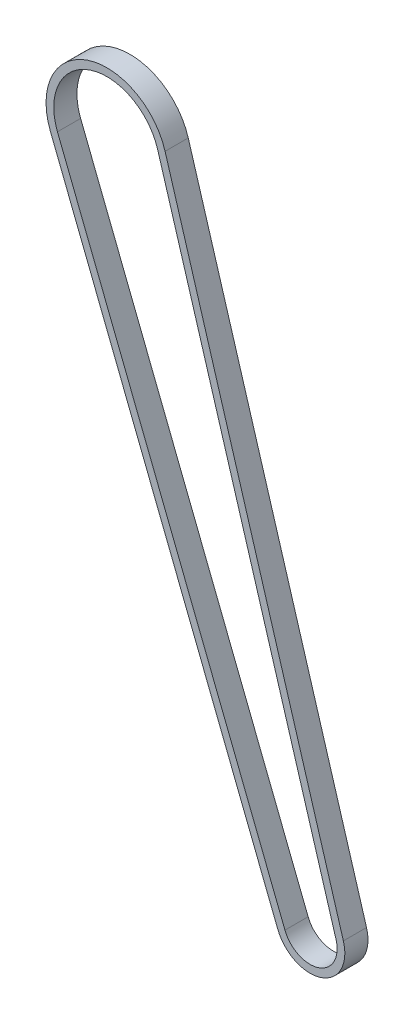
ISO-10303-21;
HEADER;
FILE_DESCRIPTION(('STEP AP214'),'2;1');
FILE_NAME('part.step','',(''),(''),'','','');
FILE_SCHEMA(('AUTOMOTIVE_DESIGN { 1 0 10303 214 1 1 1 1 }'));
ENDSEC;
DATA;
#1=APPLICATION_CONTEXT('core data for automotive mechanical design processes');
#2=APPLICATION_PROTOCOL_DEFINITION('international standard','automotive_design',2000,#1);
#3=PRODUCT_CONTEXT('',#1,'mechanical');
#4=PRODUCT('Part','Part','',(#3));
#5=PRODUCT_RELATED_PRODUCT_CATEGORY('part','',(#4));
#6=PRODUCT_DEFINITION_FORMATION('','',#4);
#7=PRODUCT_DEFINITION_CONTEXT('part definition',#1,'design');
#8=PRODUCT_DEFINITION('design','',#6,#7);
#9=PRODUCT_DEFINITION_SHAPE('','',#8);
#10=(LENGTH_UNIT() NAMED_UNIT(*) SI_UNIT(.MILLI.,.METRE.));
#11=(NAMED_UNIT(*) PLANE_ANGLE_UNIT() SI_UNIT($,.RADIAN.));
#12=(NAMED_UNIT(*) SI_UNIT($,.STERADIAN.) SOLID_ANGLE_UNIT());
#13=UNCERTAINTY_MEASURE_WITH_UNIT(LENGTH_MEASURE(1.E-05),#10,'distance_accuracy_value','');
#14=(GEOMETRIC_REPRESENTATION_CONTEXT(3) GLOBAL_UNCERTAINTY_ASSIGNED_CONTEXT((#13)) GLOBAL_UNIT_ASSIGNED_CONTEXT((#10,
#11,#12)) REPRESENTATION_CONTEXT('',''));
#15=CARTESIAN_POINT('',(0.,0.,0.));
#16=DIRECTION('',(0.,0.,1.));
#17=DIRECTION('',(1.,0.,0.));
#18=AXIS2_PLACEMENT_3D('',#15,#16,#17);
#19=CARTESIAN_POINT('',(0.,-2.22044604925031E-13,8.55000000000016));
#20=DIRECTION('',(0.,0.,1.));
#21=DIRECTION('',(1.,0.,0.));
#22=AXIS2_PLACEMENT_3D('',#19,#20,#21);
#23=CYLINDRICAL_SURFACE('',#22,9.);
#24=CARTESIAN_POINT('',(0.,-2.22044604925031E-13,14.5500000000002));
#25=DIRECTION('',(0.,0.,1.));
#26=DIRECTION('',(-1.,0.,0.));
#27=AXIS2_PLACEMENT_3D('',#24,#25,#26);
#28=CIRCLE('',#27,9.);
#29=CARTESIAN_POINT('',(-8.37394942102628,-3.29802533254295,14.5500000000002));
#30=VERTEX_POINT('',#29);
#31=CARTESIAN_POINT('',(8.6208354949425,2.58480083742218,14.5500000000002));
#32=VERTEX_POINT('',#31);
#33=EDGE_CURVE('E157',#30,#32,#28,.T.);
#34=ORIENTED_EDGE('',*,*,#33,.F.);
#35=DIRECTION('',(0.,0.,1.));
#36=VECTOR('',#35,1.);
#37=CARTESIAN_POINT('',(-8.37394942102628,-3.29802533254295,8.55000000000016));
#38=LINE('',#37,#36);
#39=CARTESIAN_POINT('',(-8.37394942102628,-3.29802533254295,8.55000000000016));
#40=VERTEX_POINT('',#39);
#41=EDGE_CURVE('E12',#40,#30,#38,.T.);
#42=ORIENTED_EDGE('',*,*,#41,.F.);
#43=CARTESIAN_POINT('',(0.,-2.22044604925031E-13,8.55000000000016));
#44=DIRECTION('',(0.,0.,1.));
#45=DIRECTION('',(-1.,0.,0.));
#46=AXIS2_PLACEMENT_3D('',#43,#44,#45);
#47=CIRCLE('',#46,9.);
#48=CARTESIAN_POINT('',(8.6208354949425,2.58480083742218,8.55000000000016));
#49=VERTEX_POINT('',#48);
#50=EDGE_CURVE('E161',#40,#49,#47,.T.);
#51=ORIENTED_EDGE('',*,*,#50,.T.);
#52=DIRECTION('',(0.,0.,1.));
#53=VECTOR('',#52,1.);
#54=CARTESIAN_POINT('',(8.6208354949425,2.58480083742218,8.55000000000016));
#55=LINE('',#54,#53);
#56=EDGE_CURVE('E62',#49,#32,#55,.T.);
#57=ORIENTED_EDGE('',*,*,#56,.T.);
#58=EDGE_LOOP('',(#34,#42,#51,#57));
#59=FACE_BOUND('',#58,.T.);
#60=ADVANCED_FACE('F59',(#59),#23,.T.);
#61=CARTESIAN_POINT('',(-8.37394942102628,-3.29802533254295,8.55000000000016));
#62=DIRECTION('',(-0.930438824558476,-0.366447259171415,0.));
#63=DIRECTION('',(0.366447259171415,-0.930438824558476,0.));
#64=AXIS2_PLACEMENT_3D('',#61,#62,#63);
#65=PLANE('',#64);
#66=DIRECTION('',(0.366447259171415,-0.930438824558476,0.));
#67=VECTOR('',#66,1.);
#68=CARTESIAN_POINT('',(-8.37394942102628,-3.29802533254295,14.5500000000002));
#69=LINE('',#68,#67);
#70=CARTESIAN_POINT('',(-67.3132086137336,146.353455668049,14.5500000000002));
#71=VERTEX_POINT('',#70);
#72=EDGE_CURVE('E165',#71,#30,#69,.T.);
#73=ORIENTED_EDGE('',*,*,#72,.F.);
#74=DIRECTION('',(0.,0.,1.));
#75=VECTOR('',#74,1.);
#76=CARTESIAN_POINT('',(-67.3132086137336,146.353455668049,8.55000000000016));
#77=LINE('',#76,#75);
#78=CARTESIAN_POINT('',(-67.3132086137336,146.353455668049,8.55000000000016));
#79=VERTEX_POINT('',#78);
#80=EDGE_CURVE('E67',#79,#71,#77,.T.);
#81=ORIENTED_EDGE('',*,*,#80,.F.);
#82=DIRECTION('',(0.366447259171415,-0.930438824558476,0.));
#83=VECTOR('',#82,1.);
#84=CARTESIAN_POINT('',(-8.37394942102628,-3.29802533254295,8.55000000000016));
#85=LINE('',#84,#83);
#86=EDGE_CURVE('E171',#79,#40,#85,.T.);
#87=ORIENTED_EDGE('',*,*,#86,.T.);
#88=ORIENTED_EDGE('',*,*,#41,.T.);
#89=EDGE_LOOP('',(#73,#81,#87,#88));
#90=FACE_BOUND('',#89,.T.);
#91=ADVANCED_FACE('F197',(#90),#65,.T.);
#92=CARTESIAN_POINT('',(-52.6587971269376,152.124999999999,8.55000000000016));
#93=DIRECTION('',(0.,0.,1.));
#94=DIRECTION('',(1.,0.,0.));
#95=AXIS2_PLACEMENT_3D('',#92,#93,#94);
#96=CYLINDRICAL_SURFACE('',#95,15.75);
#97=CARTESIAN_POINT('',(-52.6587971269376,152.124999999999,14.5500000000002));
#98=DIRECTION('',(0.,0.,1.));
#99=DIRECTION('',(-1.,0.,0.));
#100=AXIS2_PLACEMENT_3D('',#97,#98,#99);
#101=CIRCLE('',#100,15.75);
#102=CARTESIAN_POINT('',(-37.5723350107883,156.648401465488,14.5500000000002));
#103=VERTEX_POINT('',#102);
#104=EDGE_CURVE('E179',#103,#71,#101,.T.);
#105=ORIENTED_EDGE('',*,*,#104,.F.);
#106=DIRECTION('',(0.,0.,1.));
#107=VECTOR('',#106,1.);
#108=CARTESIAN_POINT('',(-37.5723350107883,156.648401465488,8.55000000000016));
#109=LINE('',#108,#107);
#110=CARTESIAN_POINT('',(-37.5723350107883,156.648401465488,8.55000000000016));
#111=VERTEX_POINT('',#110);
#112=EDGE_CURVE('E184',#111,#103,#109,.T.);
#113=ORIENTED_EDGE('',*,*,#112,.F.);
#114=CARTESIAN_POINT('',(-52.6587971269376,152.124999999999,8.55000000000016));
#115=DIRECTION('',(0.,0.,1.));
#116=DIRECTION('',(-1.,0.,0.));
#117=AXIS2_PLACEMENT_3D('',#114,#115,#116);
#118=CIRCLE('',#117,15.75);
#119=EDGE_CURVE('E168',#111,#79,#118,.T.);
#120=ORIENTED_EDGE('',*,*,#119,.T.);
#121=ORIENTED_EDGE('',*,*,#80,.T.);
#122=EDGE_LOOP('',(#105,#113,#120,#121));
#123=FACE_BOUND('',#122,.T.);
#124=ADVANCED_FACE('F201',(#123),#96,.T.);
#125=CARTESIAN_POINT('',(-37.5723350107883,156.648401465488,8.55000000000016));
#126=DIRECTION('',(0.957870610549166,0.287200093046933,0.));
#127=DIRECTION('',(-0.287200093046933,0.957870610549166,0.));
#128=AXIS2_PLACEMENT_3D('',#125,#126,#127);
#129=PLANE('',#128);
#130=DIRECTION('',(-0.287200093046933,0.957870610549166,0.));
#131=VECTOR('',#130,1.);
#132=CARTESIAN_POINT('',(-37.5723350107883,156.648401465488,14.5500000000002));
#133=LINE('',#132,#131);
#134=EDGE_CURVE('E176',#32,#103,#133,.T.);
#135=ORIENTED_EDGE('',*,*,#134,.F.);
#136=ORIENTED_EDGE('',*,*,#56,.F.);
#137=DIRECTION('',(-0.287200093046933,0.957870610549166,0.));
#138=VECTOR('',#137,1.);
#139=CARTESIAN_POINT('',(-37.5723350107883,156.648401465488,8.55000000000016));
#140=LINE('',#139,#138);
#141=EDGE_CURVE('E164',#49,#111,#140,.T.);
#142=ORIENTED_EDGE('',*,*,#141,.T.);
#143=ORIENTED_EDGE('',*,*,#112,.T.);
#144=EDGE_LOOP('',(#135,#136,#142,#143));
#145=FACE_BOUND('',#144,.T.);
#146=ADVANCED_FACE('F192',(#145),#129,.T.);
#147=CARTESIAN_POINT('',(0.,-2.22044604925031E-13,8.55000000000016));
#148=DIRECTION('',(0.,0.,1.));
#149=DIRECTION('',(1.,0.,0.));
#150=AXIS2_PLACEMENT_3D('',#147,#148,#149);
#151=PLANE('',#150);
#152=DIRECTION('',(0.366447259171415,-0.930438824558476,0.));
#153=VECTOR('',#152,1.);
#154=CARTESIAN_POINT('',(-6.51307177190933,-2.56513081420013,8.55000000000016));
#155=LINE('',#154,#153);
#156=CARTESIAN_POINT('',(-65.4523309646167,147.086350186392,8.55000000000016));
#157=VERTEX_POINT('',#156);
#158=CARTESIAN_POINT('',(-6.51307177190933,-2.56513081420013,8.55000000000016));
#159=VERTEX_POINT('',#158);
#160=EDGE_CURVE('E132',#157,#159,#155,.T.);
#161=ORIENTED_EDGE('',*,*,#160,.T.);
#162=CARTESIAN_POINT('',(0.,-2.22044604925031E-13,8.55000000000016));
#163=DIRECTION('',(0.,0.,-1.));
#164=DIRECTION('',(-1.,0.,0.));
#165=AXIS2_PLACEMENT_3D('',#162,#163,#164);
#166=CIRCLE('',#165,7.);
#167=CARTESIAN_POINT('',(6.70509427384416,2.01040065132832,8.55000000000016));
#168=VERTEX_POINT('',#167);
#169=EDGE_CURVE('E126',#159,#168,#166,.F.);
#170=ORIENTED_EDGE('',*,*,#169,.T.);
#171=DIRECTION('',(-0.287200093046933,0.957870610549166,0.));
#172=VECTOR('',#171,1.);
#173=CARTESIAN_POINT('',(6.70509427384416,2.01040065132831,8.55000000000016));
#174=LINE('',#173,#172);
#175=CARTESIAN_POINT('',(-39.4880762318866,156.074001279394,8.55000000000016));
#176=VERTEX_POINT('',#175);
#177=EDGE_CURVE('E135',#168,#176,#174,.T.);
#178=ORIENTED_EDGE('',*,*,#177,.T.);
#179=CARTESIAN_POINT('',(-52.6587971269376,152.124999999999,8.55000000000016));
#180=DIRECTION('',(0.,0.,-1.));
#181=DIRECTION('',(-1.,0.,0.));
#182=AXIS2_PLACEMENT_3D('',#179,#180,#181);
#183=CIRCLE('',#182,13.75);
#184=EDGE_CURVE('E75',#176,#157,#183,.F.);
#185=ORIENTED_EDGE('',*,*,#184,.T.);
#186=EDGE_LOOP('',(#161,#170,#178,#185));
#187=FACE_BOUND('',#186,.T.);
#188=ORIENTED_EDGE('',*,*,#50,.F.);
#189=ORIENTED_EDGE('',*,*,#86,.F.);
#190=ORIENTED_EDGE('',*,*,#119,.F.);
#191=ORIENTED_EDGE('',*,*,#141,.F.);
#192=EDGE_LOOP('',(#188,#189,#190,#191));
#193=FACE_BOUND('',#192,.T.);
#194=ADVANCED_FACE('F139',(#187,#193),#151,.F.);
#195=CARTESIAN_POINT('',(0.,-2.22044604925031E-13,14.5500000000002));
#196=DIRECTION('',(0.,0.,1.));
#197=DIRECTION('',(1.,0.,0.));
#198=AXIS2_PLACEMENT_3D('',#195,#196,#197);
#199=PLANE('',#198);
#200=CARTESIAN_POINT('',(0.,-2.22044604925031E-13,14.5500000000002));
#201=DIRECTION('',(0.,0.,-1.));
#202=DIRECTION('',(-1.,0.,0.));
#203=AXIS2_PLACEMENT_3D('',#200,#201,#202);
#204=CIRCLE('',#203,7.);
#205=CARTESIAN_POINT('',(-6.51307177190933,-2.56513081420013,14.5500000000002));
#206=VERTEX_POINT('',#205);
#207=CARTESIAN_POINT('',(6.70509427384416,2.01040065132832,14.5500000000002));
#208=VERTEX_POINT('',#207);
#209=EDGE_CURVE('E83',#206,#208,#204,.F.);
#210=ORIENTED_EDGE('',*,*,#209,.F.);
#211=DIRECTION('',(0.366447259171415,-0.930438824558476,0.));
#212=VECTOR('',#211,1.);
#213=CARTESIAN_POINT('',(-6.51307177190933,-2.56513081420013,14.5500000000002));
#214=LINE('',#213,#212);
#215=CARTESIAN_POINT('',(-65.4523309646167,147.086350186392,14.5500000000002));
#216=VERTEX_POINT('',#215);
#217=EDGE_CURVE('E142',#216,#206,#214,.T.);
#218=ORIENTED_EDGE('',*,*,#217,.F.);
#219=CARTESIAN_POINT('',(-52.6587971269376,152.124999999999,14.5500000000002));
#220=DIRECTION('',(0.,0.,-1.));
#221=DIRECTION('',(-1.,0.,0.));
#222=AXIS2_PLACEMENT_3D('',#219,#220,#221);
#223=CIRCLE('',#222,13.75);
#224=CARTESIAN_POINT('',(-39.4880762318866,156.074001279394,14.5500000000002));
#225=VERTEX_POINT('',#224);
#226=EDGE_CURVE('E145',#225,#216,#223,.F.);
#227=ORIENTED_EDGE('',*,*,#226,.F.);
#228=DIRECTION('',(-0.287200093046933,0.957870610549166,0.));
#229=VECTOR('',#228,1.);
#230=CARTESIAN_POINT('',(6.70509427384416,2.01040065132831,14.5500000000002));
#231=LINE('',#230,#229);
#232=EDGE_CURVE('E151',#208,#225,#231,.T.);
#233=ORIENTED_EDGE('',*,*,#232,.F.);
#234=EDGE_LOOP('',(#210,#218,#227,#233));
#235=FACE_BOUND('',#234,.T.);
#236=ORIENTED_EDGE('',*,*,#33,.T.);
#237=ORIENTED_EDGE('',*,*,#134,.T.);
#238=ORIENTED_EDGE('',*,*,#104,.T.);
#239=ORIENTED_EDGE('',*,*,#72,.T.);
#240=EDGE_LOOP('',(#236,#237,#238,#239));
#241=FACE_BOUND('',#240,.T.);
#242=ADVANCED_FACE('F194',(#235,#241),#199,.T.);
#243=CARTESIAN_POINT('',(0.,-2.22044604925031E-13,8.55000000000016));
#244=DIRECTION('',(0.,0.,1.));
#245=DIRECTION('',(1.,0.,0.));
#246=AXIS2_PLACEMENT_3D('',#243,#244,#245);
#247=CYLINDRICAL_SURFACE('',#246,7.);
#248=ORIENTED_EDGE('',*,*,#209,.T.);
#249=DIRECTION('',(0.,0.,1.));
#250=VECTOR('',#249,1.);
#251=CARTESIAN_POINT('',(6.70509427384416,2.01040065132832,8.55000000000016));
#252=LINE('',#251,#250);
#253=EDGE_CURVE('E122',#168,#208,#252,.T.);
#254=ORIENTED_EDGE('',*,*,#253,.F.);
#255=ORIENTED_EDGE('',*,*,#169,.F.);
#256=DIRECTION('',(0.,0.,1.));
#257=VECTOR('',#256,1.);
#258=CARTESIAN_POINT('',(-6.51307177190933,-2.56513081420013,8.55000000000016));
#259=LINE('',#258,#257);
#260=EDGE_CURVE('E155',#159,#206,#259,.T.);
#261=ORIENTED_EDGE('',*,*,#260,.T.);
#262=EDGE_LOOP('',(#248,#254,#255,#261));
#263=FACE_BOUND('',#262,.T.);
#264=ADVANCED_FACE('F124',(#263),#247,.F.);
#265=CARTESIAN_POINT('',(-6.51307177190933,-2.56513081420013,8.55000000000016));
#266=DIRECTION('',(-0.930438824558476,-0.366447259171415,0.));
#267=DIRECTION('',(0.366447259171415,-0.930438824558476,0.));
#268=AXIS2_PLACEMENT_3D('',#265,#266,#267);
#269=PLANE('',#268);
#270=ORIENTED_EDGE('',*,*,#217,.T.);
#271=ORIENTED_EDGE('',*,*,#260,.F.);
#272=ORIENTED_EDGE('',*,*,#160,.F.);
#273=DIRECTION('',(0.,0.,1.));
#274=VECTOR('',#273,1.);
#275=CARTESIAN_POINT('',(-65.4523309646167,147.086350186392,8.55000000000016));
#276=LINE('',#275,#274);
#277=EDGE_CURVE('E158',#157,#216,#276,.T.);
#278=ORIENTED_EDGE('',*,*,#277,.T.);
#279=EDGE_LOOP('',(#270,#271,#272,#278));
#280=FACE_BOUND('',#279,.T.);
#281=ADVANCED_FACE('F252',(#280),#269,.F.);
#282=CARTESIAN_POINT('',(-52.6587971269376,152.124999999999,8.55000000000016));
#283=DIRECTION('',(0.,0.,1.));
#284=DIRECTION('',(1.,0.,0.));
#285=AXIS2_PLACEMENT_3D('',#282,#283,#284);
#286=CYLINDRICAL_SURFACE('',#285,13.75);
#287=ORIENTED_EDGE('',*,*,#226,.T.);
#288=ORIENTED_EDGE('',*,*,#277,.F.);
#289=ORIENTED_EDGE('',*,*,#184,.F.);
#290=DIRECTION('',(0.,0.,1.));
#291=VECTOR('',#290,1.);
#292=CARTESIAN_POINT('',(-39.4880762318866,156.074001279394,8.55000000000016));
#293=LINE('',#292,#291);
#294=EDGE_CURVE('E131',#176,#225,#293,.T.);
#295=ORIENTED_EDGE('',*,*,#294,.T.);
#296=EDGE_LOOP('',(#287,#288,#289,#295));
#297=FACE_BOUND('',#296,.T.);
#298=ADVANCED_FACE('F261',(#297),#286,.F.);
#299=CARTESIAN_POINT('',(6.70509427384416,2.01040065132831,8.55000000000016));
#300=DIRECTION('',(0.957870610549166,0.287200093046933,0.));
#301=DIRECTION('',(-0.287200093046933,0.957870610549166,0.));
#302=AXIS2_PLACEMENT_3D('',#299,#300,#301);
#303=PLANE('',#302);
#304=ORIENTED_EDGE('',*,*,#232,.T.);
#305=ORIENTED_EDGE('',*,*,#294,.F.);
#306=ORIENTED_EDGE('',*,*,#177,.F.);
#307=ORIENTED_EDGE('',*,*,#253,.T.);
#308=EDGE_LOOP('',(#304,#305,#306,#307));
#309=FACE_BOUND('',#308,.T.);
#310=ADVANCED_FACE('F136',(#309),#303,.F.);
#311=CLOSED_SHELL('',(#60,#91,#124,#146,#194,#242,#264,#281,#298,#310));
#312=MANIFOLD_SOLID_BREP('B2',#311);
#313=ADVANCED_BREP_SHAPE_REPRESENTATION('',(#18,#312),#14);
#314=SHAPE_DEFINITION_REPRESENTATION(#9,#313);
ENDSEC;
END-ISO-10303-21;
